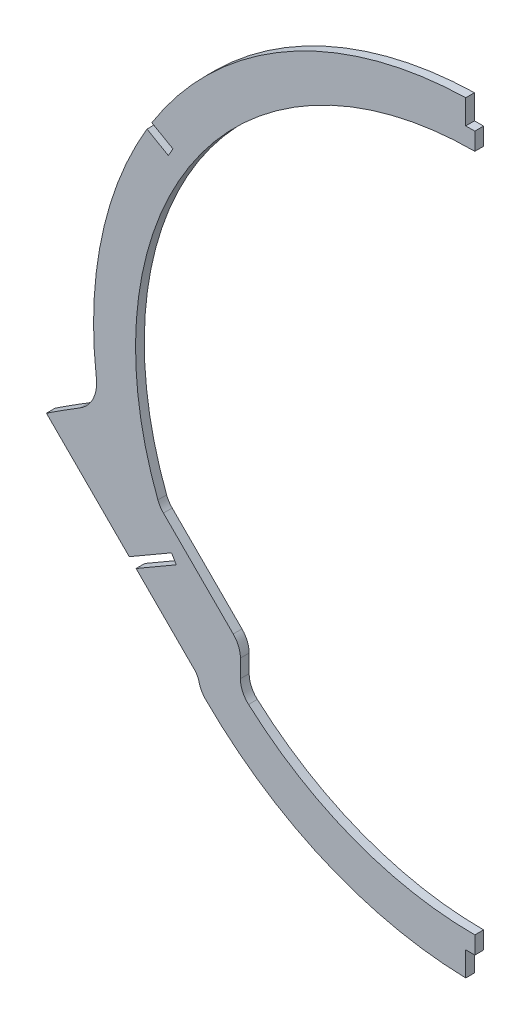
ISO-10303-21;
HEADER;
FILE_DESCRIPTION(('STEP AP214'),'2;1');
FILE_NAME('part.step','',(''),(''),'','','');
FILE_SCHEMA(('AUTOMOTIVE_DESIGN { 1 0 10303 214 1 1 1 1 }'));
ENDSEC;
DATA;
#1=APPLICATION_CONTEXT('core data for automotive mechanical design processes');
#2=APPLICATION_PROTOCOL_DEFINITION('international standard','automotive_design',2000,#1);
#3=PRODUCT_CONTEXT('',#1,'mechanical');
#4=PRODUCT('Part','Part','',(#3));
#5=PRODUCT_RELATED_PRODUCT_CATEGORY('part','',(#4));
#6=PRODUCT_DEFINITION_FORMATION('','',#4);
#7=PRODUCT_DEFINITION_CONTEXT('part definition',#1,'design');
#8=PRODUCT_DEFINITION('design','',#6,#7);
#9=PRODUCT_DEFINITION_SHAPE('','',#8);
#10=(LENGTH_UNIT() NAMED_UNIT(*) SI_UNIT(.MILLI.,.METRE.));
#11=(NAMED_UNIT(*) PLANE_ANGLE_UNIT() SI_UNIT($,.RADIAN.));
#12=(NAMED_UNIT(*) SI_UNIT($,.STERADIAN.) SOLID_ANGLE_UNIT());
#13=UNCERTAINTY_MEASURE_WITH_UNIT(LENGTH_MEASURE(1.E-05),#10,'distance_accuracy_value','');
#14=(GEOMETRIC_REPRESENTATION_CONTEXT(3) GLOBAL_UNCERTAINTY_ASSIGNED_CONTEXT((#13)) GLOBAL_UNIT_ASSIGNED_CONTEXT((#10,
#11,#12)) REPRESENTATION_CONTEXT('',''));
#15=CARTESIAN_POINT('',(0.,0.,0.));
#16=DIRECTION('',(0.,0.,1.));
#17=DIRECTION('',(1.,0.,0.));
#18=AXIS2_PLACEMENT_3D('',#15,#16,#17);
#19=CARTESIAN_POINT('',(0.,21.844,1.5875));
#20=DIRECTION('',(0.,0.,-1.));
#21=DIRECTION('',(-1.,0.,0.));
#22=AXIS2_PLACEMENT_3D('',#19,#20,#21);
#23=CYLINDRICAL_SURFACE('',#22,138.43);
#24=CARTESIAN_POINT('',(0.,21.844,1.5875));
#25=DIRECTION('',(0.,0.,1.));
#26=DIRECTION('',(1.,0.,0.));
#27=AXIS2_PLACEMENT_3D('',#24,#25,#26);
#28=CIRCLE('',#27,138.43);
#29=CARTESIAN_POINT('',(-3.302,160.234612745229,1.58750000000002));
#30=VERTEX_POINT('',#29);
#31=CARTESIAN_POINT('',(-117.26786762869,95.4042618389856,1.58750000000002));
#32=VERTEX_POINT('',#31);
#33=EDGE_CURVE('E358',#30,#32,#28,.T.);
#34=ORIENTED_EDGE('',*,*,#33,.F.);
#35=DIRECTION('',(0.,0.,-1.));
#36=VECTOR('',#35,1.);
#37=CARTESIAN_POINT('',(-3.302,160.234612745229,1.5875));
#38=LINE('',#37,#36);
#39=CARTESIAN_POINT('',(-3.302,160.234612745229,-1.5875));
#40=VERTEX_POINT('',#39);
#41=EDGE_CURVE('E239',#30,#40,#38,.T.);
#42=ORIENTED_EDGE('',*,*,#41,.T.);
#43=CARTESIAN_POINT('',(0.,21.844,-1.5875));
#44=DIRECTION('',(0.,0.,1.));
#45=DIRECTION('',(1.,0.,0.));
#46=AXIS2_PLACEMENT_3D('',#43,#44,#45);
#47=CIRCLE('',#46,138.43);
#48=CARTESIAN_POINT('',(-117.26786762869,95.4042618389856,-1.5875));
#49=VERTEX_POINT('',#48);
#50=EDGE_CURVE('E363',#40,#49,#47,.T.);
#51=ORIENTED_EDGE('',*,*,#50,.T.);
#52=DIRECTION('',(0.,0.,-1.));
#53=VECTOR('',#52,1.);
#54=CARTESIAN_POINT('',(-117.26786762869,95.4042618389856,1.5875));
#55=LINE('',#54,#53);
#56=EDGE_CURVE('E309',#49,#32,#55,.F.);
#57=ORIENTED_EDGE('',*,*,#56,.T.);
#58=EDGE_LOOP('',(#34,#42,#51,#57));
#59=FACE_BOUND('',#58,.T.);
#60=ADVANCED_FACE('F36',(#59),#23,.T.);
#61=CARTESIAN_POINT('',(-100.34409646219,-70.2778643001988,1.5875));
#62=DIRECTION('',(0.707175129954027,0.707038425811854,0.));
#63=DIRECTION('',(-0.707038425811854,0.707175129954027,0.));
#64=AXIS2_PLACEMENT_3D('',#61,#62,#63);
#65=PLANE('',#64);
#66=DIRECTION('',(0.707038425811854,-0.707175129954027,0.));
#67=VECTOR('',#66,1.);
#68=CARTESIAN_POINT('',(-100.34409646219,-70.2778643001988,1.5875));
#69=LINE('',#68,#67);
#70=CARTESIAN_POINT('',(-122.988854127876,-47.6287283262646,1.58750000000002));
#71=VERTEX_POINT('',#70);
#72=CARTESIAN_POINT('',(-101.829943115467,-68.7917303621218,1.5875));
#73=VERTEX_POINT('',#72);
#74=EDGE_CURVE('E316',#71,#73,#69,.T.);
#75=ORIENTED_EDGE('',*,*,#74,.F.);
#76=DIRECTION('',(0.,0.,-1.));
#77=VECTOR('',#76,1.);
#78=CARTESIAN_POINT('',(-122.988854127876,-47.6287283262646,1.5875));
#79=LINE('',#78,#77);
#80=CARTESIAN_POINT('',(-122.988854127876,-47.6287283262646,-1.5875));
#81=VERTEX_POINT('',#80);
#82=EDGE_CURVE('E44',#71,#81,#79,.T.);
#83=ORIENTED_EDGE('',*,*,#82,.T.);
#84=DIRECTION('',(0.707038425811854,-0.707175129954027,0.));
#85=VECTOR('',#84,1.);
#86=CARTESIAN_POINT('',(-100.34409646219,-70.2778643001988,-1.5875));
#87=LINE('',#86,#85);
#88=CARTESIAN_POINT('',(-101.829943115467,-68.7917303621218,-1.5875));
#89=VERTEX_POINT('',#88);
#90=EDGE_CURVE('E323',#81,#89,#87,.T.);
#91=ORIENTED_EDGE('',*,*,#90,.T.);
#92=DIRECTION('',(0.,0.,-1.));
#93=VECTOR('',#92,1.);
#94=CARTESIAN_POINT('',(-101.829943115467,-68.7917303621218,1.5875));
#95=LINE('',#94,#93);
#96=EDGE_CURVE('E419',#89,#73,#95,.F.);
#97=ORIENTED_EDGE('',*,*,#96,.T.);
#98=EDGE_LOOP('',(#75,#83,#91,#97));
#99=FACE_BOUND('',#98,.T.);
#100=ADVANCED_FACE('F433',(#99),#65,.F.);
#101=CARTESIAN_POINT('',(-119.028614444151,92.5196948569002,1.58750000000002));
#102=VERTEX_POINT('',#101);
#103=CARTESIAN_POINT('',(-137.406736765671,5.04359549863482,1.5875));
#104=VERTEX_POINT('',#103);
#105=EDGE_CURVE('E359',#102,#104,#28,.T.);
#106=ORIENTED_EDGE('',*,*,#105,.F.);
#107=DIRECTION('',(0.,0.,-1.));
#108=VECTOR('',#107,1.);
#109=CARTESIAN_POINT('',(-119.028614444151,92.5196948569002,1.5875));
#110=LINE('',#109,#108);
#111=CARTESIAN_POINT('',(-119.028614444151,92.5196948569002,-1.5875));
#112=VERTEX_POINT('',#111);
#113=EDGE_CURVE('E306',#102,#112,#110,.T.);
#114=ORIENTED_EDGE('',*,*,#113,.T.);
#115=CARTESIAN_POINT('',(-137.406736765671,5.04359549863482,-1.5875));
#116=VERTEX_POINT('',#115);
#117=EDGE_CURVE('E353',#112,#116,#47,.T.);
#118=ORIENTED_EDGE('',*,*,#117,.T.);
#119=DIRECTION('',(0.,0.,-1.));
#120=VECTOR('',#119,1.);
#121=CARTESIAN_POINT('',(-137.406736765671,5.04359549863482,1.5875));
#122=LINE('',#121,#120);
#123=EDGE_CURVE('E408',#116,#104,#122,.F.);
#124=ORIENTED_EDGE('',*,*,#123,.T.);
#125=EDGE_LOOP('',(#106,#114,#118,#124));
#126=FACE_BOUND('',#125,.T.);
#127=ADVANCED_FACE('F510',(#126),#23,.T.);
#128=CARTESIAN_POINT('',(-91.4625405555822,-69.8904824758851,1.5875));
#129=DIRECTION('',(0.,0.,-1.));
#130=DIRECTION('',(-1.,0.,0.));
#131=AXIS2_PLACEMENT_3D('',#128,#129,#130);
#132=CYLINDRICAL_SURFACE('',#131,8.89);
#133=CARTESIAN_POINT('',(-91.4625405555822,-69.8904824758851,1.5875));
#134=DIRECTION('',(0.,0.,1.));
#135=DIRECTION('',(1.,0.,0.));
#136=AXIS2_PLACEMENT_3D('',#133,#134,#135);
#137=CIRCLE('',#136,8.89);
#138=CARTESIAN_POINT('',(-100.12968659272,-71.8685319118013,1.5875));
#139=VERTEX_POINT('',#138);
#140=CARTESIAN_POINT('',(-97.7393815741026,-76.1859861752106,1.5875));
#141=VERTEX_POINT('',#140);
#142=EDGE_CURVE('E373',#139,#141,#137,.T.);
#143=ORIENTED_EDGE('',*,*,#142,.F.);
#144=DIRECTION('',(0.,0.,-1.));
#145=VECTOR('',#144,1.);
#146=CARTESIAN_POINT('',(-100.12968659272,-71.8685319118013,1.5875));
#147=LINE('',#146,#145);
#148=CARTESIAN_POINT('',(-100.12968659272,-71.8685319118013,-1.5875));
#149=VERTEX_POINT('',#148);
#150=EDGE_CURVE('E416',#139,#149,#147,.T.);
#151=ORIENTED_EDGE('',*,*,#150,.T.);
#152=CARTESIAN_POINT('',(-91.4625405555822,-69.8904824758851,-1.5875));
#153=DIRECTION('',(0.,0.,1.));
#154=DIRECTION('',(1.,0.,0.));
#155=AXIS2_PLACEMENT_3D('',#152,#153,#154);
#156=CIRCLE('',#155,8.89);
#157=CARTESIAN_POINT('',(-97.7393815741026,-76.1859861752106,-1.5875));
#158=VERTEX_POINT('',#157);
#159=EDGE_CURVE('E365',#158,#149,#156,.F.);
#160=ORIENTED_EDGE('',*,*,#159,.F.);
#161=DIRECTION('',(0.,0.,-1.));
#162=VECTOR('',#161,1.);
#163=CARTESIAN_POINT('',(-97.7393815741026,-76.1859861752106,1.5875));
#164=LINE('',#163,#162);
#165=EDGE_CURVE('E368',#141,#158,#164,.T.);
#166=ORIENTED_EDGE('',*,*,#165,.F.);
#167=EDGE_LOOP('',(#143,#151,#160,#166));
#168=FACE_BOUND('',#167,.T.);
#169=ADVANCED_FACE('F450',(#168),#132,.T.);
#170=CARTESIAN_POINT('',(-3.30200000000001,-116.546612745229,-1.5875));
#171=VERTEX_POINT('',#170);
#172=EDGE_CURVE('E360',#158,#171,#47,.T.);
#173=ORIENTED_EDGE('',*,*,#172,.T.);
#174=DIRECTION('',(0.,0.,-1.));
#175=VECTOR('',#174,1.);
#176=CARTESIAN_POINT('',(-3.30200000000001,-116.546612745229,1.5875));
#177=LINE('',#176,#175);
#178=CARTESIAN_POINT('',(-3.30200000000001,-116.546612745229,1.58750000000002));
#179=VERTEX_POINT('',#178);
#180=EDGE_CURVE('E232',#171,#179,#177,.F.);
#181=ORIENTED_EDGE('',*,*,#180,.T.);
#182=EDGE_CURVE('E354',#141,#179,#28,.T.);
#183=ORIENTED_EDGE('',*,*,#182,.F.);
#184=ORIENTED_EDGE('',*,*,#165,.T.);
#185=EDGE_LOOP('',(#173,#181,#183,#184));
#186=FACE_BOUND('',#185,.T.);
#187=ADVANCED_FACE('F452',(#186),#23,.T.);
#188=CARTESIAN_POINT('',(0.,21.844,1.5875));
#189=DIRECTION('',(0.,0.,1.));
#190=DIRECTION('',(1.,0.,0.));
#191=AXIS2_PLACEMENT_3D('',#188,#189,#190);
#192=PLANE('',#191);
#193=DIRECTION('',(0.,1.,0.));
#194=VECTOR('',#193,1.);
#195=CARTESIAN_POINT('',(-3.302,151.384,1.58750000000002));
#196=LINE('',#195,#194);
#197=CARTESIAN_POINT('',(-3.302,151.384,1.58750000000002));
#198=VERTEX_POINT('',#197);
#199=EDGE_CURVE('E236',#198,#30,#196,.T.);
#200=ORIENTED_EDGE('',*,*,#199,.T.);
#201=ORIENTED_EDGE('',*,*,#33,.T.);
#202=DIRECTION('',(0.867621916047048,-0.497224507435876,0.));
#203=VECTOR('',#202,1.);
#204=CARTESIAN_POINT('',(-109.59849619829,91.0090300435539,1.58750000000002));
#205=LINE('',#204,#203);
#206=CARTESIAN_POINT('',(-109.59849619829,91.0090300435539,1.58750000000002));
#207=VERTEX_POINT('',#206);
#208=EDGE_CURVE('E262',#32,#207,#205,.T.);
#209=ORIENTED_EDGE('',*,*,#208,.T.);
#210=DIRECTION('',(-0.497224507435874,-0.867621916047049,0.));
#211=VECTOR('',#210,1.);
#212=CARTESIAN_POINT('',(-109.59849619829,91.0090300435539,1.58750000000002));
#213=LINE('',#212,#211);
#214=CARTESIAN_POINT('',(-111.27822002931,88.0780296867637,1.58750000000002));
#215=VERTEX_POINT('',#214);
#216=EDGE_CURVE('E266',#207,#215,#213,.T.);
#217=ORIENTED_EDGE('',*,*,#216,.T.);
#218=DIRECTION('',(-0.867621916047048,0.497224507435875,0.));
#219=VECTOR('',#218,1.);
#220=CARTESIAN_POINT('',(-111.27822002931,88.0780296867637,1.58750000000002));
#221=LINE('',#220,#219);
#222=EDGE_CURVE('E256',#215,#102,#221,.T.);
#223=ORIENTED_EDGE('',*,*,#222,.T.);
#224=ORIENTED_EDGE('',*,*,#105,.T.);
#225=CARTESIAN_POINT('',(-150.012859404724,3.50227398474811,1.5875));
#226=DIRECTION('',(0.,0.,1.));
#227=DIRECTION('',(1.,0.,0.));
#228=AXIS2_PLACEMENT_3D('',#225,#226,#227);
#229=CIRCLE('',#228,12.7);
#230=CARTESIAN_POINT('',(-143.371678677667,-7.32291509214883,1.5875));
#231=VERTEX_POINT('',#230);
#232=EDGE_CURVE('E414',#104,#231,#229,.F.);
#233=ORIENTED_EDGE('',*,*,#232,.T.);
#234=CARTESIAN_POINT('',(85.5484326939528,-380.46491964655,1.5875));
#235=DIRECTION('',(0.,0.,1.));
#236=DIRECTION('',(1.,0.,0.));
#237=AXIS2_PLACEMENT_3D('',#234,#235,#236);
#238=CIRCLE('',#237,437.766345158318);
#239=CARTESIAN_POINT('',(-155.54266677163,-15.0686214828328,1.5875));
#240=VERTEX_POINT('',#239);
#241=EDGE_CURVE('E314',#231,#240,#238,.T.);
#242=ORIENTED_EDGE('',*,*,#241,.T.);
#243=CARTESIAN_POINT('',(-125.460509120375,-45.156595445346,1.5875));
#244=VERTEX_POINT('',#243);
#245=EDGE_CURVE('E318',#240,#244,#69,.T.);
#246=ORIENTED_EDGE('',*,*,#245,.T.);
#247=DIRECTION('',(0.86522438992145,0.501384837310677,0.));
#248=VECTOR('',#247,1.);
#249=CARTESIAN_POINT('',(-110.102498062291,-36.2568534067837,1.58750000000002));
#250=LINE('',#249,#248);
#251=CARTESIAN_POINT('',(-110.102498062291,-36.2568534067837,1.58750000000002));
#252=VERTEX_POINT('',#251);
#253=EDGE_CURVE('E287',#244,#252,#250,.T.);
#254=ORIENTED_EDGE('',*,*,#253,.T.);
#255=DIRECTION('',(0.501384837310676,-0.865224389921451,0.));
#256=VECTOR('',#255,1.);
#257=CARTESIAN_POINT('',(-108.408719804888,-39.1797544408163,1.58750000000002));
#258=LINE('',#257,#256);
#259=CARTESIAN_POINT('',(-108.408719804888,-39.1797544408163,1.58750000000002));
#260=VERTEX_POINT('',#259);
#261=EDGE_CURVE('E274',#252,#260,#258,.T.);
#262=ORIENTED_EDGE('',*,*,#261,.T.);
#263=DIRECTION('',(-0.86522438992145,-0.501384837310678,0.));
#264=VECTOR('',#263,1.);
#265=CARTESIAN_POINT('',(-108.408719804888,-39.1797544408163,1.58750000000002));
#266=LINE('',#265,#264);
#267=EDGE_CURVE('E282',#260,#71,#266,.T.);
#268=ORIENTED_EDGE('',*,*,#267,.T.);
#269=ORIENTED_EDGE('',*,*,#74,.T.);
#270=CARTESIAN_POINT('',(-106.320505190675,-73.2814243660271,1.5875));
#271=DIRECTION('',(0.,0.,1.));
#272=DIRECTION('',(1.,0.,0.));
#273=AXIS2_PLACEMENT_3D('',#270,#271,#272);
#274=CIRCLE('',#273,6.35);
#275=EDGE_CURVE('E425',#73,#139,#274,.F.);
#276=ORIENTED_EDGE('',*,*,#275,.T.);
#277=ORIENTED_EDGE('',*,*,#142,.T.);
#278=ORIENTED_EDGE('',*,*,#182,.T.);
#279=DIRECTION('',(0.,1.,0.));
#280=VECTOR('',#279,1.);
#281=CARTESIAN_POINT('',(-3.30200000000001,-107.696,1.58750000000002));
#282=LINE('',#281,#280);
#283=CARTESIAN_POINT('',(-3.30200000000001,-107.696,1.58750000000002));
#284=VERTEX_POINT('',#283);
#285=EDGE_CURVE('E298',#179,#284,#282,.T.);
#286=ORIENTED_EDGE('',*,*,#285,.T.);
#287=DIRECTION('',(1.,0.,0.));
#288=VECTOR('',#287,1.);
#289=CARTESIAN_POINT('',(0.,-107.696,1.58750000000002));
#290=LINE('',#289,#288);
#291=CARTESIAN_POINT('',(0.,-107.696,1.58750000000002));
#292=VERTEX_POINT('',#291);
#293=EDGE_CURVE('E294',#284,#292,#290,.T.);
#294=ORIENTED_EDGE('',*,*,#293,.T.);
#295=DIRECTION('',(0.,1.,0.));
#296=VECTOR('',#295,1.);
#297=CARTESIAN_POINT('',(0.,21.844,1.5875));
#298=LINE('',#297,#296);
#299=CARTESIAN_POINT('',(0.,-101.346,1.58750000000002));
#300=VERTEX_POINT('',#299);
#301=EDGE_CURVE('E330',#292,#300,#298,.T.);
#302=ORIENTED_EDGE('',*,*,#301,.T.);
#303=CARTESIAN_POINT('',(0.,21.844,1.5875));
#304=DIRECTION('',(0.,0.,1.));
#305=DIRECTION('',(1.,0.,0.));
#306=AXIS2_PLACEMENT_3D('',#303,#304,#305);
#307=CIRCLE('',#306,123.19);
#308=CARTESIAN_POINT('',(-82.150960376572,-69.9546699751522,1.5875));
#309=VERTEX_POINT('',#308);
#310=EDGE_CURVE('E342',#309,#300,#307,.T.);
#311=ORIENTED_EDGE('',*,*,#310,.F.);
#312=CARTESIAN_POINT('',(-76.2225405555822,-63.3300236882855,1.58750000000002));
#313=DIRECTION('',(0.,0.,1.));
#314=DIRECTION('',(1.,0.,0.));
#315=AXIS2_PLACEMENT_3D('',#312,#313,#314);
#316=CIRCLE('',#315,8.89);
#317=CARTESIAN_POINT('',(-85.1125405555823,-63.3300236882855,1.5875));
#318=VERTEX_POINT('',#317);
#319=EDGE_CURVE('E395',#309,#318,#316,.F.);
#320=ORIENTED_EDGE('',*,*,#319,.T.);
#321=DIRECTION('',(0.,-1.,0.));
#322=VECTOR('',#321,1.);
#323=CARTESIAN_POINT('',(-85.1125405555823,-53.1834037088829,1.5875));
#324=LINE('',#323,#322);
#325=CARTESIAN_POINT('',(-85.1125405555823,-56.8657622783797,1.5875));
#326=VERTEX_POINT('',#325);
#327=EDGE_CURVE('E337',#326,#318,#324,.T.);
#328=ORIENTED_EDGE('',*,*,#327,.F.);
#329=CARTESIAN_POINT('',(-94.0025405555823,-56.8657622783797,1.58750000000002));
#330=DIRECTION('',(0.,0.,1.));
#331=DIRECTION('',(1.,0.,0.));
#332=AXIS2_PLACEMENT_3D('',#329,#330,#331);
#333=CIRCLE('',#332,8.89);
#334=CARTESIAN_POINT('',(-87.7163612708339,-50.5795829936313,1.5875));
#335=VERTEX_POINT('',#334);
#336=EDGE_CURVE('E371',#326,#335,#333,.T.);
#337=ORIENTED_EDGE('',*,*,#336,.T.);
#338=DIRECTION('',(0.707106781186551,-0.707106781186544,0.));
#339=VECTOR('',#338,1.);
#340=CARTESIAN_POINT('',(-114.372852663516,-23.9230916009498,1.5875));
#341=LINE('',#340,#339);
#342=CARTESIAN_POINT('',(-113.057801903825,-25.2381423606409,1.5875));
#343=VERTEX_POINT('',#342);
#344=EDGE_CURVE('E345',#343,#335,#341,.T.);
#345=ORIENTED_EDGE('',*,*,#344,.F.);
#346=CARTESIAN_POINT('',(-106.771622619076,-18.9519630758925,1.58750000000002));
#347=DIRECTION('',(0.,0.,1.));
#348=DIRECTION('',(1.,0.,0.));
#349=AXIS2_PLACEMENT_3D('',#346,#347,#348);
#350=CIRCLE('',#349,8.89);
#351=CARTESIAN_POINT('',(-115.076082156115,-22.1249824262397,1.5875));
#352=VERTEX_POINT('',#351);
#353=EDGE_CURVE('E390',#343,#352,#350,.F.);
#354=ORIENTED_EDGE('',*,*,#353,.T.);
#355=CARTESIAN_POINT('',(0.,145.034,1.5875));
#356=VERTEX_POINT('',#355);
#357=EDGE_CURVE('E346',#356,#352,#307,.T.);
#358=ORIENTED_EDGE('',*,*,#357,.F.);
#359=CARTESIAN_POINT('',(0.,151.384,1.5875));
#360=VERTEX_POINT('',#359);
#361=EDGE_CURVE('E247',#356,#360,#298,.T.);
#362=ORIENTED_EDGE('',*,*,#361,.T.);
#363=DIRECTION('',(-1.,0.,0.));
#364=VECTOR('',#363,1.);
#365=CARTESIAN_POINT('',(0.,151.384,1.58750000000002));
#366=LINE('',#365,#364);
#367=EDGE_CURVE('E226',#360,#198,#366,.T.);
#368=ORIENTED_EDGE('',*,*,#367,.T.);
#369=EDGE_LOOP('',(#200,#201,#209,#217,#223,#224,#233,#242,#246,#254,#262,#268,#269,#276,#277,
#278,#286,#294,#302,#311,#320,#328,#337,#345,#354,#358,#362,#368));
#370=FACE_BOUND('',#369,.T.);
#371=ADVANCED_FACE('F245',(#370),#192,.T.);
#372=CARTESIAN_POINT('',(0.,21.844,-1.5875));
#373=DIRECTION('',(0.,0.,1.));
#374=DIRECTION('',(1.,0.,0.));
#375=AXIS2_PLACEMENT_3D('',#372,#373,#374);
#376=PLANE('',#375);
#377=ORIENTED_EDGE('',*,*,#50,.F.);
#378=DIRECTION('',(0.,1.,0.));
#379=VECTOR('',#378,1.);
#380=CARTESIAN_POINT('',(-3.302,151.384,-1.5875));
#381=LINE('',#380,#379);
#382=CARTESIAN_POINT('',(-3.302,151.384,-1.5875));
#383=VERTEX_POINT('',#382);
#384=EDGE_CURVE('E251',#383,#40,#381,.T.);
#385=ORIENTED_EDGE('',*,*,#384,.F.);
#386=DIRECTION('',(-1.,0.,0.));
#387=VECTOR('',#386,1.);
#388=CARTESIAN_POINT('',(0.,151.384,-1.5875));
#389=LINE('',#388,#387);
#390=CARTESIAN_POINT('',(0.,151.384,-1.5875));
#391=VERTEX_POINT('',#390);
#392=EDGE_CURVE('E229',#391,#383,#389,.T.);
#393=ORIENTED_EDGE('',*,*,#392,.F.);
#394=DIRECTION('',(0.,1.,0.));
#395=VECTOR('',#394,1.);
#396=CARTESIAN_POINT('',(0.,21.844,-1.5875));
#397=LINE('',#396,#395);
#398=CARTESIAN_POINT('',(0.,145.034,-1.58750000000002));
#399=VERTEX_POINT('',#398);
#400=EDGE_CURVE('E331',#399,#391,#397,.T.);
#401=ORIENTED_EDGE('',*,*,#400,.F.);
#402=CARTESIAN_POINT('',(0.,21.844,-1.58750000000002));
#403=DIRECTION('',(0.,0.,1.));
#404=DIRECTION('',(1.,0.,0.));
#405=AXIS2_PLACEMENT_3D('',#402,#403,#404);
#406=CIRCLE('',#405,123.19);
#407=CARTESIAN_POINT('',(-115.076082156115,-22.1249824262397,-1.58750000000002));
#408=VERTEX_POINT('',#407);
#409=EDGE_CURVE('E338',#408,#399,#406,.F.);
#410=ORIENTED_EDGE('',*,*,#409,.F.);
#411=CARTESIAN_POINT('',(-106.771622619076,-18.9519630758925,-1.58750000000002));
#412=DIRECTION('',(0.,0.,1.));
#413=DIRECTION('',(1.,0.,0.));
#414=AXIS2_PLACEMENT_3D('',#411,#412,#413);
#415=CIRCLE('',#414,8.89);
#416=CARTESIAN_POINT('',(-113.057801903825,-25.2381423606409,-1.58750000000002));
#417=VERTEX_POINT('',#416);
#418=EDGE_CURVE('E393',#408,#417,#415,.T.);
#419=ORIENTED_EDGE('',*,*,#418,.T.);
#420=DIRECTION('',(-0.707106781186551,0.707106781186544,0.));
#421=VECTOR('',#420,1.);
#422=CARTESIAN_POINT('',(-114.372852663516,-23.9230916009498,-1.58750000000002));
#423=LINE('',#422,#421);
#424=CARTESIAN_POINT('',(-87.7163612708339,-50.5795829936313,-1.58750000000002));
#425=VERTEX_POINT('',#424);
#426=EDGE_CURVE('E341',#425,#417,#423,.T.);
#427=ORIENTED_EDGE('',*,*,#426,.F.);
#428=CARTESIAN_POINT('',(-94.0025405555823,-56.8657622783797,-1.58750000000002));
#429=DIRECTION('',(0.,0.,1.));
#430=DIRECTION('',(1.,0.,0.));
#431=AXIS2_PLACEMENT_3D('',#428,#429,#430);
#432=CIRCLE('',#431,8.89);
#433=CARTESIAN_POINT('',(-85.1125405555823,-56.8657622783797,-1.58750000000002));
#434=VERTEX_POINT('',#433);
#435=EDGE_CURVE('E357',#425,#434,#432,.F.);
#436=ORIENTED_EDGE('',*,*,#435,.T.);
#437=DIRECTION('',(0.,1.,0.));
#438=VECTOR('',#437,1.);
#439=CARTESIAN_POINT('',(-85.1125405555823,-53.1834037088829,-1.58750000000002));
#440=LINE('',#439,#438);
#441=CARTESIAN_POINT('',(-85.1125405555823,-63.3300236882855,-1.58750000000002));
#442=VERTEX_POINT('',#441);
#443=EDGE_CURVE('E333',#442,#434,#440,.T.);
#444=ORIENTED_EDGE('',*,*,#443,.F.);
#445=CARTESIAN_POINT('',(-76.2225405555822,-63.3300236882855,-1.58750000000002));
#446=DIRECTION('',(0.,0.,1.));
#447=DIRECTION('',(1.,0.,0.));
#448=AXIS2_PLACEMENT_3D('',#445,#446,#447);
#449=CIRCLE('',#448,8.89);
#450=CARTESIAN_POINT('',(-82.150960376572,-69.9546699751522,-1.58750000000002));
#451=VERTEX_POINT('',#450);
#452=EDGE_CURVE('E397',#442,#451,#449,.T.);
#453=ORIENTED_EDGE('',*,*,#452,.T.);
#454=CARTESIAN_POINT('',(0.,-101.346,-1.58750000000002));
#455=VERTEX_POINT('',#454);
#456=EDGE_CURVE('E336',#455,#451,#406,.F.);
#457=ORIENTED_EDGE('',*,*,#456,.F.);
#458=CARTESIAN_POINT('',(0.,-107.696,-1.5875));
#459=VERTEX_POINT('',#458);
#460=EDGE_CURVE('E328',#459,#455,#397,.T.);
#461=ORIENTED_EDGE('',*,*,#460,.F.);
#462=DIRECTION('',(1.,0.,0.));
#463=VECTOR('',#462,1.);
#464=CARTESIAN_POINT('',(0.,-107.696,-1.5875));
#465=LINE('',#464,#463);
#466=CARTESIAN_POINT('',(-3.30200000000001,-107.696,-1.5875));
#467=VERTEX_POINT('',#466);
#468=EDGE_CURVE('E59',#467,#459,#465,.T.);
#469=ORIENTED_EDGE('',*,*,#468,.F.);
#470=DIRECTION('',(0.,1.,0.));
#471=VECTOR('',#470,1.);
#472=CARTESIAN_POINT('',(-3.30200000000001,-107.696,-1.5875));
#473=LINE('',#472,#471);
#474=EDGE_CURVE('E277',#171,#467,#473,.T.);
#475=ORIENTED_EDGE('',*,*,#474,.F.);
#476=ORIENTED_EDGE('',*,*,#172,.F.);
#477=ORIENTED_EDGE('',*,*,#159,.T.);
#478=CARTESIAN_POINT('',(-106.320505190675,-73.2814243660271,-1.5875));
#479=DIRECTION('',(0.,0.,1.));
#480=DIRECTION('',(1.,0.,0.));
#481=AXIS2_PLACEMENT_3D('',#478,#479,#480);
#482=CIRCLE('',#481,6.35);
#483=EDGE_CURVE('E422',#149,#89,#482,.T.);
#484=ORIENTED_EDGE('',*,*,#483,.T.);
#485=ORIENTED_EDGE('',*,*,#90,.F.);
#486=DIRECTION('',(-0.86522438992145,-0.501384837310678,0.));
#487=VECTOR('',#486,1.);
#488=CARTESIAN_POINT('',(-108.408719804888,-39.1797544408163,-1.5875));
#489=LINE('',#488,#487);
#490=CARTESIAN_POINT('',(-108.408719804888,-39.1797544408163,-1.5875));
#491=VERTEX_POINT('',#490);
#492=EDGE_CURVE('E259',#491,#81,#489,.T.);
#493=ORIENTED_EDGE('',*,*,#492,.F.);
#494=DIRECTION('',(0.501384837310676,-0.865224389921451,0.));
#495=VECTOR('',#494,1.);
#496=CARTESIAN_POINT('',(-108.408719804888,-39.1797544408163,-1.5875));
#497=LINE('',#496,#495);
#498=CARTESIAN_POINT('',(-110.102498062291,-36.2568534067837,-1.5875));
#499=VERTEX_POINT('',#498);
#500=EDGE_CURVE('E278',#499,#491,#497,.T.);
#501=ORIENTED_EDGE('',*,*,#500,.F.);
#502=DIRECTION('',(0.86522438992145,0.501384837310677,0.));
#503=VECTOR('',#502,1.);
#504=CARTESIAN_POINT('',(-110.102498062291,-36.2568534067837,-1.5875));
#505=LINE('',#504,#503);
#506=CARTESIAN_POINT('',(-125.460509120375,-45.156595445346,-1.5875));
#507=VERTEX_POINT('',#506);
#508=EDGE_CURVE('E281',#507,#499,#505,.T.);
#509=ORIENTED_EDGE('',*,*,#508,.F.);
#510=CARTESIAN_POINT('',(-155.54266677163,-15.0686214828328,-1.5875));
#511=VERTEX_POINT('',#510);
#512=EDGE_CURVE('E317',#511,#507,#87,.T.);
#513=ORIENTED_EDGE('',*,*,#512,.F.);
#514=CARTESIAN_POINT('',(85.5484326939528,-380.46491964655,-1.5875));
#515=DIRECTION('',(0.,0.,1.));
#516=DIRECTION('',(1.,0.,0.));
#517=AXIS2_PLACEMENT_3D('',#514,#515,#516);
#518=CIRCLE('',#517,437.766345158318);
#519=CARTESIAN_POINT('',(-143.371678677667,-7.32291509214883,-1.5875));
#520=VERTEX_POINT('',#519);
#521=EDGE_CURVE('E313',#520,#511,#518,.T.);
#522=ORIENTED_EDGE('',*,*,#521,.F.);
#523=CARTESIAN_POINT('',(-150.012859404724,3.50227398474811,-1.5875));
#524=DIRECTION('',(0.,0.,1.));
#525=DIRECTION('',(1.,0.,0.));
#526=AXIS2_PLACEMENT_3D('',#523,#524,#525);
#527=CIRCLE('',#526,12.7);
#528=EDGE_CURVE('E411',#520,#116,#527,.T.);
#529=ORIENTED_EDGE('',*,*,#528,.T.);
#530=ORIENTED_EDGE('',*,*,#117,.F.);
#531=DIRECTION('',(-0.867621916047048,0.497224507435875,0.));
#532=VECTOR('',#531,1.);
#533=CARTESIAN_POINT('',(-111.27822002931,88.0780296867637,-1.5875));
#534=LINE('',#533,#532);
#535=CARTESIAN_POINT('',(-111.27822002931,88.0780296867637,-1.5875));
#536=VERTEX_POINT('',#535);
#537=EDGE_CURVE('E260',#536,#112,#534,.T.);
#538=ORIENTED_EDGE('',*,*,#537,.F.);
#539=DIRECTION('',(-0.497224507435874,-0.867621916047049,0.));
#540=VECTOR('',#539,1.);
#541=CARTESIAN_POINT('',(-109.59849619829,91.0090300435539,-1.5875));
#542=LINE('',#541,#540);
#543=CARTESIAN_POINT('',(-109.59849619829,91.0090300435539,-1.5875));
#544=VERTEX_POINT('',#543);
#545=EDGE_CURVE('E253',#544,#536,#542,.T.);
#546=ORIENTED_EDGE('',*,*,#545,.F.);
#547=DIRECTION('',(-0.867621916047048,0.497224507435876,0.));
#548=VECTOR('',#547,1.);
#549=CARTESIAN_POINT('',(2.74171463060379,26.6280998693442,-1.5875));
#550=LINE('',#549,#548);
#551=EDGE_CURVE('E11',#544,#49,#550,.T.);
#552=ORIENTED_EDGE('',*,*,#551,.T.);
#553=EDGE_LOOP('',(#377,#385,#393,#401,#410,#419,#427,#436,#444,#453,#457,#461,#469,#475,#476,
#477,#484,#485,#493,#501,#509,#513,#522,#529,#530,#538,#546,#552));
#554=FACE_BOUND('',#553,.T.);
#555=ADVANCED_FACE('F439',(#554),#376,.F.);
#556=CARTESIAN_POINT('',(0.,21.844,-350.021437497483));
#557=DIRECTION('',(0.,0.,1.));
#558=DIRECTION('',(1.,0.,0.));
#559=AXIS2_PLACEMENT_3D('',#556,#557,#558);
#560=CYLINDRICAL_SURFACE('',#559,123.19);
#561=DIRECTION('',(0.,0.,1.));
#562=VECTOR('',#561,1.);
#563=CARTESIAN_POINT('',(0.,145.034,-350.021437497483));
#564=LINE('',#563,#562);
#565=EDGE_CURVE('E403',#356,#399,#564,.F.);
#566=ORIENTED_EDGE('',*,*,#565,.F.);
#567=ORIENTED_EDGE('',*,*,#357,.T.);
#568=DIRECTION('',(0.,0.,1.));
#569=VECTOR('',#568,1.);
#570=CARTESIAN_POINT('',(-115.076082156115,-22.1249824262397,-350.021437497483));
#571=LINE('',#570,#569);
#572=EDGE_CURVE('E383',#352,#408,#571,.F.);
#573=ORIENTED_EDGE('',*,*,#572,.T.);
#574=ORIENTED_EDGE('',*,*,#409,.T.);
#575=EDGE_LOOP('',(#566,#567,#573,#574));
#576=FACE_BOUND('',#575,.T.);
#577=ADVANCED_FACE('F497',(#576),#560,.F.);
#578=DIRECTION('',(0.,0.,1.));
#579=VECTOR('',#578,1.);
#580=CARTESIAN_POINT('',(0.,-101.346,-350.021437497483));
#581=LINE('',#580,#579);
#582=EDGE_CURVE('E400',#455,#300,#581,.T.);
#583=ORIENTED_EDGE('',*,*,#582,.F.);
#584=ORIENTED_EDGE('',*,*,#456,.T.);
#585=DIRECTION('',(0.,0.,1.));
#586=VECTOR('',#585,1.);
#587=CARTESIAN_POINT('',(-82.1509603765719,-69.9546699751522,-350.021437497483));
#588=LINE('',#587,#586);
#589=EDGE_CURVE('E380',#451,#309,#588,.T.);
#590=ORIENTED_EDGE('',*,*,#589,.T.);
#591=ORIENTED_EDGE('',*,*,#310,.T.);
#592=EDGE_LOOP('',(#583,#584,#590,#591));
#593=FACE_BOUND('',#592,.T.);
#594=ADVANCED_FACE('F466',(#593),#560,.F.);
#595=CARTESIAN_POINT('',(-85.1125405555823,-53.1834037088829,-350.021437497483));
#596=DIRECTION('',(-1.,0.,0.));
#597=DIRECTION('',(0.,-1.,0.));
#598=AXIS2_PLACEMENT_3D('',#595,#596,#597);
#599=PLANE('',#598);
#600=ORIENTED_EDGE('',*,*,#443,.T.);
#601=DIRECTION('',(0.,0.,1.));
#602=VECTOR('',#601,1.);
#603=CARTESIAN_POINT('',(-85.1125405555823,-56.8657622783797,-350.021437497483));
#604=LINE('',#603,#602);
#605=EDGE_CURVE('E387',#434,#326,#604,.T.);
#606=ORIENTED_EDGE('',*,*,#605,.T.);
#607=ORIENTED_EDGE('',*,*,#327,.T.);
#608=DIRECTION('',(0.,0.,-1.));
#609=VECTOR('',#608,1.);
#610=CARTESIAN_POINT('',(-85.1125405555823,-63.3300236882855,-1.58750000000013));
#611=LINE('',#610,#609);
#612=EDGE_CURVE('E385',#318,#442,#611,.T.);
#613=ORIENTED_EDGE('',*,*,#612,.T.);
#614=EDGE_LOOP('',(#600,#606,#607,#613));
#615=FACE_BOUND('',#614,.T.);
#616=ADVANCED_FACE('F472',(#615),#599,.F.);
#617=CARTESIAN_POINT('',(-114.372852663516,-23.9230916009498,-350.021437497483));
#618=DIRECTION('',(-0.707106781186544,-0.707106781186551,0.));
#619=DIRECTION('',(0.707106781186551,-0.707106781186544,0.));
#620=AXIS2_PLACEMENT_3D('',#617,#618,#619);
#621=PLANE('',#620);
#622=ORIENTED_EDGE('',*,*,#426,.T.);
#623=DIRECTION('',(0.,0.,-1.));
#624=VECTOR('',#623,1.);
#625=CARTESIAN_POINT('',(-113.057801903825,-25.2381423606409,1.58749999999991));
#626=LINE('',#625,#624);
#627=EDGE_CURVE('E377',#417,#343,#626,.F.);
#628=ORIENTED_EDGE('',*,*,#627,.T.);
#629=ORIENTED_EDGE('',*,*,#344,.T.);
#630=DIRECTION('',(0.,0.,1.));
#631=VECTOR('',#630,1.);
#632=CARTESIAN_POINT('',(-87.7163612708339,-50.5795829936313,-350.021437497483));
#633=LINE('',#632,#631);
#634=EDGE_CURVE('E375',#335,#425,#633,.F.);
#635=ORIENTED_EDGE('',*,*,#634,.T.);
#636=EDGE_LOOP('',(#622,#628,#629,#635));
#637=FACE_BOUND('',#636,.T.);
#638=ADVANCED_FACE('F484',(#637),#621,.F.);
#639=CARTESIAN_POINT('',(-106.771622619076,-18.9519630758925,-350.021437497483));
#640=DIRECTION('',(0.,0.,1.));
#641=DIRECTION('',(1.,0.,0.));
#642=AXIS2_PLACEMENT_3D('',#639,#640,#641);
#643=CYLINDRICAL_SURFACE('',#642,8.89);
#644=ORIENTED_EDGE('',*,*,#418,.F.);
#645=ORIENTED_EDGE('',*,*,#572,.F.);
#646=ORIENTED_EDGE('',*,*,#353,.F.);
#647=ORIENTED_EDGE('',*,*,#627,.F.);
#648=EDGE_LOOP('',(#644,#645,#646,#647));
#649=FACE_BOUND('',#648,.T.);
#650=ADVANCED_FACE('F488',(#649),#643,.F.);
#651=CARTESIAN_POINT('',(-94.0025405555823,-56.8657622783797,-350.021437497483));
#652=DIRECTION('',(0.,0.,1.));
#653=DIRECTION('',(1.,0.,0.));
#654=AXIS2_PLACEMENT_3D('',#651,#652,#653);
#655=CYLINDRICAL_SURFACE('',#654,8.89);
#656=ORIENTED_EDGE('',*,*,#435,.F.);
#657=ORIENTED_EDGE('',*,*,#634,.F.);
#658=ORIENTED_EDGE('',*,*,#336,.F.);
#659=ORIENTED_EDGE('',*,*,#605,.F.);
#660=EDGE_LOOP('',(#656,#657,#658,#659));
#661=FACE_BOUND('',#660,.T.);
#662=ADVANCED_FACE('F480',(#661),#655,.T.);
#663=CARTESIAN_POINT('',(-76.2225405555822,-63.3300236882855,-350.021437497483));
#664=DIRECTION('',(0.,0.,1.));
#665=DIRECTION('',(1.,0.,0.));
#666=AXIS2_PLACEMENT_3D('',#663,#664,#665);
#667=CYLINDRICAL_SURFACE('',#666,8.89);
#668=ORIENTED_EDGE('',*,*,#452,.F.);
#669=ORIENTED_EDGE('',*,*,#612,.F.);
#670=ORIENTED_EDGE('',*,*,#319,.F.);
#671=ORIENTED_EDGE('',*,*,#589,.F.);
#672=EDGE_LOOP('',(#668,#669,#670,#671));
#673=FACE_BOUND('',#672,.T.);
#674=ADVANCED_FACE('F476',(#673),#667,.F.);
#675=CARTESIAN_POINT('',(0.,0.,0.));
#676=DIRECTION('',(1.,0.,0.));
#677=DIRECTION('',(0.,0.,-1.));
#678=AXIS2_PLACEMENT_3D('',#675,#676,#677);
#679=PLANE('',#678);
#680=DIRECTION('',(0.,0.,-1.));
#681=VECTOR('',#680,1.);
#682=CARTESIAN_POINT('',(0.,-107.696,1.58750000000002));
#683=LINE('',#682,#681);
#684=EDGE_CURVE('E295',#292,#459,#683,.T.);
#685=ORIENTED_EDGE('',*,*,#684,.T.);
#686=ORIENTED_EDGE('',*,*,#460,.T.);
#687=ORIENTED_EDGE('',*,*,#582,.T.);
#688=ORIENTED_EDGE('',*,*,#301,.F.);
#689=EDGE_LOOP('',(#685,#686,#687,#688));
#690=FACE_BOUND('',#689,.T.);
#691=ADVANCED_FACE('F462',(#690),#679,.T.);
#692=DIRECTION('',(0.,0.,-1.));
#693=VECTOR('',#692,1.);
#694=CARTESIAN_POINT('',(0.,151.384,1.58750000000002));
#695=LINE('',#694,#693);
#696=EDGE_CURVE('E233',#360,#391,#695,.T.);
#697=ORIENTED_EDGE('',*,*,#696,.F.);
#698=ORIENTED_EDGE('',*,*,#361,.F.);
#699=ORIENTED_EDGE('',*,*,#565,.T.);
#700=ORIENTED_EDGE('',*,*,#400,.T.);
#701=EDGE_LOOP('',(#697,#698,#699,#700));
#702=FACE_BOUND('',#701,.T.);
#703=ADVANCED_FACE('F495',(#702),#679,.T.);
#704=CARTESIAN_POINT('',(85.5484326939528,-380.46491964655,1.5875));
#705=DIRECTION('',(0.,0.,-1.));
#706=DIRECTION('',(-1.,0.,0.));
#707=AXIS2_PLACEMENT_3D('',#704,#705,#706);
#708=CYLINDRICAL_SURFACE('',#707,437.766345158318);
#709=ORIENTED_EDGE('',*,*,#241,.F.);
#710=DIRECTION('',(0.,0.,-1.));
#711=VECTOR('',#710,1.);
#712=CARTESIAN_POINT('',(-143.371678677667,-7.32291509214877,1.5875));
#713=LINE('',#712,#711);
#714=EDGE_CURVE('E405',#231,#520,#713,.T.);
#715=ORIENTED_EDGE('',*,*,#714,.T.);
#716=ORIENTED_EDGE('',*,*,#521,.T.);
#717=DIRECTION('',(0.,0.,-1.));
#718=VECTOR('',#717,1.);
#719=CARTESIAN_POINT('',(-155.54266677163,-15.0686214828328,1.5875));
#720=LINE('',#719,#718);
#721=EDGE_CURVE('E321',#240,#511,#720,.T.);
#722=ORIENTED_EDGE('',*,*,#721,.F.);
#723=EDGE_LOOP('',(#709,#715,#716,#722));
#724=FACE_BOUND('',#723,.T.);
#725=ADVANCED_FACE('F539',(#724),#708,.T.);
#726=ORIENTED_EDGE('',*,*,#512,.T.);
#727=DIRECTION('',(0.,0.,1.));
#728=VECTOR('',#727,1.);
#729=CARTESIAN_POINT('',(-125.460509120375,-45.156595445346,1.5875));
#730=LINE('',#729,#728);
#731=EDGE_CURVE('E427',#507,#244,#730,.T.);
#732=ORIENTED_EDGE('',*,*,#731,.T.);
#733=ORIENTED_EDGE('',*,*,#245,.F.);
#734=ORIENTED_EDGE('',*,*,#721,.T.);
#735=EDGE_LOOP('',(#726,#732,#733,#734));
#736=FACE_BOUND('',#735,.T.);
#737=ADVANCED_FACE('F515',(#736),#65,.F.);
#738=CARTESIAN_POINT('',(-150.012859404724,3.50227398474811,1.5875));
#739=DIRECTION('',(0.,0.,1.));
#740=DIRECTION('',(1.,0.,0.));
#741=AXIS2_PLACEMENT_3D('',#738,#739,#740);
#742=CYLINDRICAL_SURFACE('',#741,12.7);
#743=ORIENTED_EDGE('',*,*,#232,.F.);
#744=ORIENTED_EDGE('',*,*,#123,.F.);
#745=ORIENTED_EDGE('',*,*,#528,.F.);
#746=ORIENTED_EDGE('',*,*,#714,.F.);
#747=EDGE_LOOP('',(#743,#744,#745,#746));
#748=FACE_BOUND('',#747,.T.);
#749=ADVANCED_FACE('F531',(#748),#742,.F.);
#750=CARTESIAN_POINT('',(-106.320505190675,-73.2814243660271,1.5875));
#751=DIRECTION('',(0.,0.,-1.));
#752=DIRECTION('',(-1.,0.,0.));
#753=AXIS2_PLACEMENT_3D('',#750,#751,#752);
#754=CYLINDRICAL_SURFACE('',#753,6.35);
#755=ORIENTED_EDGE('',*,*,#275,.F.);
#756=ORIENTED_EDGE('',*,*,#96,.F.);
#757=ORIENTED_EDGE('',*,*,#483,.F.);
#758=ORIENTED_EDGE('',*,*,#150,.F.);
#759=EDGE_LOOP('',(#755,#756,#757,#758));
#760=FACE_BOUND('',#759,.T.);
#761=ADVANCED_FACE('F38',(#760),#754,.F.);
#762=CARTESIAN_POINT('',(-108.408719804888,-39.1797544408163,1.58750000000002));
#763=DIRECTION('',(0.501384837310678,-0.86522438992145,0.));
#764=DIRECTION('',(0.86522438992145,0.501384837310678,0.));
#765=AXIS2_PLACEMENT_3D('',#762,#763,#764);
#766=PLANE('',#765);
#767=ORIENTED_EDGE('',*,*,#267,.F.);
#768=DIRECTION('',(0.,0.,-1.));
#769=VECTOR('',#768,1.);
#770=CARTESIAN_POINT('',(-108.408719804888,-39.1797544408163,1.58750000000002));
#771=LINE('',#770,#769);
#772=EDGE_CURVE('E275',#260,#491,#771,.T.);
#773=ORIENTED_EDGE('',*,*,#772,.T.);
#774=ORIENTED_EDGE('',*,*,#492,.T.);
#775=ORIENTED_EDGE('',*,*,#82,.F.);
#776=EDGE_LOOP('',(#767,#773,#774,#775));
#777=FACE_BOUND('',#776,.T.);
#778=ADVANCED_FACE('F538',(#777),#766,.F.);
#779=CARTESIAN_POINT('',(-110.102498062291,-36.2568534067837,1.58750000000002));
#780=DIRECTION('',(-0.501384837310677,0.86522438992145,0.));
#781=DIRECTION('',(-0.86522438992145,-0.501384837310677,0.));
#782=AXIS2_PLACEMENT_3D('',#779,#780,#781);
#783=PLANE('',#782);
#784=ORIENTED_EDGE('',*,*,#508,.T.);
#785=DIRECTION('',(0.,0.,-1.));
#786=VECTOR('',#785,1.);
#787=CARTESIAN_POINT('',(-110.102498062291,-36.2568534067837,1.58750000000002));
#788=LINE('',#787,#786);
#789=EDGE_CURVE('E271',#252,#499,#788,.T.);
#790=ORIENTED_EDGE('',*,*,#789,.F.);
#791=ORIENTED_EDGE('',*,*,#253,.F.);
#792=ORIENTED_EDGE('',*,*,#731,.F.);
#793=EDGE_LOOP('',(#784,#790,#791,#792));
#794=FACE_BOUND('',#793,.T.);
#795=ADVANCED_FACE('F553',(#794),#783,.F.);
#796=CARTESIAN_POINT('',(-108.408719804888,-39.1797544408163,1.58750000000002));
#797=DIRECTION('',(0.865224389921451,0.501384837310676,0.));
#798=DIRECTION('',(-0.501384837310676,0.865224389921451,0.));
#799=AXIS2_PLACEMENT_3D('',#796,#797,#798);
#800=PLANE('',#799);
#801=ORIENTED_EDGE('',*,*,#500,.T.);
#802=ORIENTED_EDGE('',*,*,#772,.F.);
#803=ORIENTED_EDGE('',*,*,#261,.F.);
#804=ORIENTED_EDGE('',*,*,#789,.T.);
#805=EDGE_LOOP('',(#801,#802,#803,#804));
#806=FACE_BOUND('',#805,.T.);
#807=ADVANCED_FACE('F556',(#806),#800,.F.);
#808=CARTESIAN_POINT('',(-3.302,151.384,1.58750000000002));
#809=DIRECTION('',(-1.,0.,0.));
#810=DIRECTION('',(0.,0.,1.));
#811=AXIS2_PLACEMENT_3D('',#808,#809,#810);
#812=PLANE('',#811);
#813=ORIENTED_EDGE('',*,*,#199,.F.);
#814=DIRECTION('',(0.,0.,-1.));
#815=VECTOR('',#814,1.);
#816=CARTESIAN_POINT('',(-3.302,151.384,1.58750000000002));
#817=LINE('',#816,#815);
#818=EDGE_CURVE('E222',#198,#383,#817,.T.);
#819=ORIENTED_EDGE('',*,*,#818,.T.);
#820=ORIENTED_EDGE('',*,*,#384,.T.);
#821=ORIENTED_EDGE('',*,*,#41,.F.);
#822=EDGE_LOOP('',(#813,#819,#820,#821));
#823=FACE_BOUND('',#822,.T.);
#824=ADVANCED_FACE('F237',(#823),#812,.F.);
#825=CARTESIAN_POINT('',(0.,151.384,1.58750000000002));
#826=DIRECTION('',(0.,-1.,0.));
#827=DIRECTION('',(0.,0.,-1.));
#828=AXIS2_PLACEMENT_3D('',#825,#826,#827);
#829=PLANE('',#828);
#830=ORIENTED_EDGE('',*,*,#392,.T.);
#831=ORIENTED_EDGE('',*,*,#818,.F.);
#832=ORIENTED_EDGE('',*,*,#367,.F.);
#833=ORIENTED_EDGE('',*,*,#696,.T.);
#834=EDGE_LOOP('',(#830,#831,#832,#833));
#835=FACE_BOUND('',#834,.T.);
#836=ADVANCED_FACE('F224',(#835),#829,.F.);
#837=CARTESIAN_POINT('',(-3.30200000000001,-107.696,1.58750000000002));
#838=DIRECTION('',(-1.,0.,0.));
#839=DIRECTION('',(0.,0.,1.));
#840=AXIS2_PLACEMENT_3D('',#837,#838,#839);
#841=PLANE('',#840);
#842=ORIENTED_EDGE('',*,*,#474,.T.);
#843=DIRECTION('',(0.,0.,-1.));
#844=VECTOR('',#843,1.);
#845=CARTESIAN_POINT('',(-3.30200000000001,-107.696,1.58750000000002));
#846=LINE('',#845,#844);
#847=EDGE_CURVE('E292',#284,#467,#846,.T.);
#848=ORIENTED_EDGE('',*,*,#847,.F.);
#849=ORIENTED_EDGE('',*,*,#285,.F.);
#850=ORIENTED_EDGE('',*,*,#180,.F.);
#851=EDGE_LOOP('',(#842,#848,#849,#850));
#852=FACE_BOUND('',#851,.T.);
#853=ADVANCED_FACE('F456',(#852),#841,.F.);
#854=CARTESIAN_POINT('',(0.,-107.696,1.58750000000002));
#855=DIRECTION('',(0.,1.,0.));
#856=DIRECTION('',(0.,0.,1.));
#857=AXIS2_PLACEMENT_3D('',#854,#855,#856);
#858=PLANE('',#857);
#859=ORIENTED_EDGE('',*,*,#468,.T.);
#860=ORIENTED_EDGE('',*,*,#684,.F.);
#861=ORIENTED_EDGE('',*,*,#293,.F.);
#862=ORIENTED_EDGE('',*,*,#847,.T.);
#863=EDGE_LOOP('',(#859,#860,#861,#862));
#864=FACE_BOUND('',#863,.T.);
#865=ADVANCED_FACE('F458',(#864),#858,.F.);
#866=CARTESIAN_POINT('',(-109.59849619829,91.0090300435539,1.58750000000002));
#867=DIRECTION('',(0.497224507435876,0.867621916047048,0.));
#868=DIRECTION('',(-0.867621916047048,0.497224507435876,0.));
#869=AXIS2_PLACEMENT_3D('',#866,#867,#868);
#870=PLANE('',#869);
#871=ORIENTED_EDGE('',*,*,#551,.F.);
#872=DIRECTION('',(0.,0.,-1.));
#873=VECTOR('',#872,1.);
#874=CARTESIAN_POINT('',(-109.59849619829,91.0090300435539,1.58750000000002));
#875=LINE('',#874,#873);
#876=EDGE_CURVE('E51',#207,#544,#875,.T.);
#877=ORIENTED_EDGE('',*,*,#876,.F.);
#878=ORIENTED_EDGE('',*,*,#208,.F.);
#879=ORIENTED_EDGE('',*,*,#56,.F.);
#880=EDGE_LOOP('',(#871,#877,#878,#879));
#881=FACE_BOUND('',#880,.T.);
#882=ADVANCED_FACE('F572',(#881),#870,.F.);
#883=CARTESIAN_POINT('',(-111.27822002931,88.0780296867637,1.58750000000002));
#884=DIRECTION('',(-0.497224507435875,-0.867621916047048,0.));
#885=DIRECTION('',(0.867621916047048,-0.497224507435875,0.));
#886=AXIS2_PLACEMENT_3D('',#883,#884,#885);
#887=PLANE('',#886);
#888=ORIENTED_EDGE('',*,*,#222,.F.);
#889=DIRECTION('',(0.,0.,-1.));
#890=VECTOR('',#889,1.);
#891=CARTESIAN_POINT('',(-111.27822002931,88.0780296867637,1.58750000000002));
#892=LINE('',#891,#890);
#893=EDGE_CURVE('E257',#215,#536,#892,.T.);
#894=ORIENTED_EDGE('',*,*,#893,.T.);
#895=ORIENTED_EDGE('',*,*,#537,.T.);
#896=ORIENTED_EDGE('',*,*,#113,.F.);
#897=EDGE_LOOP('',(#888,#894,#895,#896));
#898=FACE_BOUND('',#897,.T.);
#899=ADVANCED_FACE('F564',(#898),#887,.F.);
#900=CARTESIAN_POINT('',(-109.59849619829,91.0090300435539,1.58750000000002));
#901=DIRECTION('',(0.867621916047049,-0.497224507435874,0.));
#902=DIRECTION('',(0.497224507435874,0.867621916047049,0.));
#903=AXIS2_PLACEMENT_3D('',#900,#901,#902);
#904=PLANE('',#903);
#905=ORIENTED_EDGE('',*,*,#545,.T.);
#906=ORIENTED_EDGE('',*,*,#893,.F.);
#907=ORIENTED_EDGE('',*,*,#216,.F.);
#908=ORIENTED_EDGE('',*,*,#876,.T.);
#909=EDGE_LOOP('',(#905,#906,#907,#908));
#910=FACE_BOUND('',#909,.T.);
#911=ADVANCED_FACE('F685',(#910),#904,.F.);
#912=CLOSED_SHELL('',(#60,#100,#127,#169,#187,#371,#555,#577,#594,#616,#638,#650,#662,#674,#691,
#703,#725,#737,#749,#761,#778,#795,#807,#824,#836,#853,#865,#882,#899,#911));
#913=MANIFOLD_SOLID_BREP('B2',#912);
#914=ADVANCED_BREP_SHAPE_REPRESENTATION('',(#18,#913),#14);
#915=SHAPE_DEFINITION_REPRESENTATION(#9,#914);
ENDSEC;
END-ISO-10303-21;
